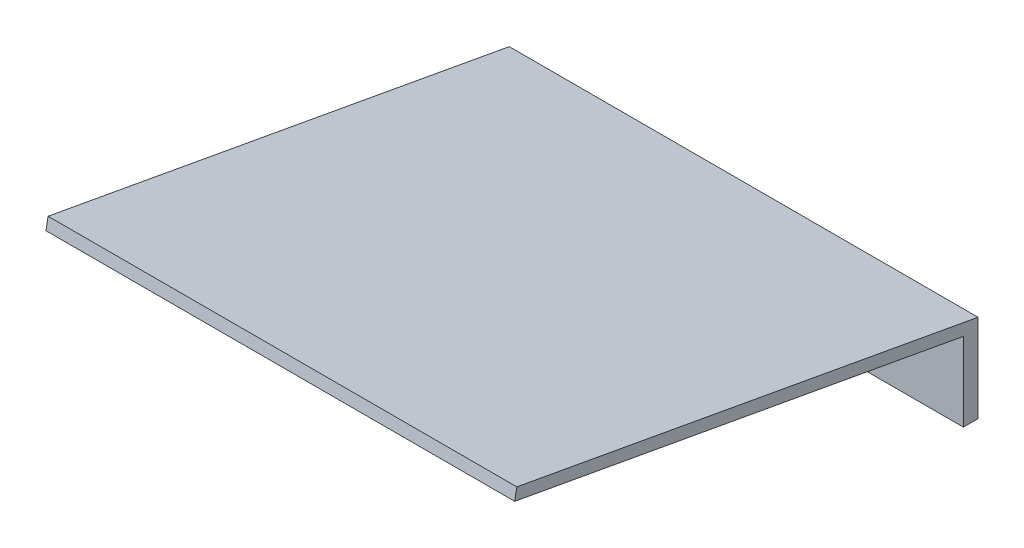
ISO-10303-21;
HEADER;
FILE_DESCRIPTION(('STEP AP214'),'2;1');
FILE_NAME('part.step','',(''),(''),'','','');
FILE_SCHEMA(('AUTOMOTIVE_DESIGN { 1 0 10303 214 1 1 1 1 }'));
ENDSEC;
DATA;
#1=APPLICATION_CONTEXT('core data for automotive mechanical design processes');
#2=APPLICATION_PROTOCOL_DEFINITION('international standard','automotive_design',2000,#1);
#3=PRODUCT_CONTEXT('',#1,'mechanical');
#4=PRODUCT('Part','Part','',(#3));
#5=PRODUCT_RELATED_PRODUCT_CATEGORY('part','',(#4));
#6=PRODUCT_DEFINITION_FORMATION('','',#4);
#7=PRODUCT_DEFINITION_CONTEXT('part definition',#1,'design');
#8=PRODUCT_DEFINITION('design','',#6,#7);
#9=PRODUCT_DEFINITION_SHAPE('','',#8);
#10=(LENGTH_UNIT() NAMED_UNIT(*) SI_UNIT(.MILLI.,.METRE.));
#11=(NAMED_UNIT(*) PLANE_ANGLE_UNIT() SI_UNIT($,.RADIAN.));
#12=(NAMED_UNIT(*) SI_UNIT($,.STERADIAN.) SOLID_ANGLE_UNIT());
#13=UNCERTAINTY_MEASURE_WITH_UNIT(LENGTH_MEASURE(1.E-05),#10,'distance_accuracy_value','');
#14=(GEOMETRIC_REPRESENTATION_CONTEXT(3) GLOBAL_UNCERTAINTY_ASSIGNED_CONTEXT((#13)) GLOBAL_UNIT_ASSIGNED_CONTEXT((#10,
#11,#12)) REPRESENTATION_CONTEXT('',''));
#15=CARTESIAN_POINT('',(0.,0.,0.));
#16=DIRECTION('',(0.,0.,1.));
#17=DIRECTION('',(1.,0.,0.));
#18=AXIS2_PLACEMENT_3D('',#15,#16,#17);
#19=CARTESIAN_POINT('',(40.,13.4210348666984,2.5));
#20=DIRECTION('',(0.,0.,1.));
#21=DIRECTION('',(1.,0.,0.));
#22=AXIS2_PLACEMENT_3D('',#19,#20,#21);
#23=PLANE('',#22);
#24=DIRECTION('',(0.,-1.,0.));
#25=VECTOR('',#24,1.);
#26=CARTESIAN_POINT('',(120.,13.4210348666984,2.5));
#27=LINE('',#26,#25);
#28=CARTESIAN_POINT('',(120.,13.4210348666984,2.5));
#29=VERTEX_POINT('',#28);
#30=CARTESIAN_POINT('',(120.,0.,2.5));
#31=VERTEX_POINT('',#30);
#32=EDGE_CURVE('E118',#29,#31,#27,.T.);
#33=ORIENTED_EDGE('',*,*,#32,.F.);
#34=DIRECTION('',(1.,0.,0.));
#35=VECTOR('',#34,1.);
#36=CARTESIAN_POINT('',(40.,13.4210348666984,2.5));
#37=LINE('',#36,#35);
#38=CARTESIAN_POINT('',(40.,13.4210348666984,2.5));
#39=VERTEX_POINT('',#38);
#40=EDGE_CURVE('E11',#39,#29,#37,.T.);
#41=ORIENTED_EDGE('',*,*,#40,.F.);
#42=DIRECTION('',(0.,-1.,0.));
#43=VECTOR('',#42,1.);
#44=CARTESIAN_POINT('',(40.,13.4210348666984,2.5));
#45=LINE('',#44,#43);
#46=CARTESIAN_POINT('',(40.,0.,2.5));
#47=VERTEX_POINT('',#46);
#48=EDGE_CURVE('E132',#39,#47,#45,.T.);
#49=ORIENTED_EDGE('',*,*,#48,.T.);
#50=DIRECTION('',(1.,0.,0.));
#51=VECTOR('',#50,1.);
#52=CARTESIAN_POINT('',(40.,0.,2.5));
#53=LINE('',#52,#51);
#54=EDGE_CURVE('E36',#47,#31,#53,.T.);
#55=ORIENTED_EDGE('',*,*,#54,.T.);
#56=EDGE_LOOP('',(#33,#41,#49,#55));
#57=FACE_BOUND('',#56,.T.);
#58=ADVANCED_FACE('F33',(#57),#23,.T.);
#59=CARTESIAN_POINT('',(40.,27.3173186584393,79.0713833258687));
#60=DIRECTION('',(0.,-0.983928174383606,0.178564687590081));
#61=DIRECTION('',(0.,-0.178564687590081,-0.983928174383607));
#62=AXIS2_PLACEMENT_3D('',#59,#60,#61);
#63=PLANE('',#62);
#64=DIRECTION('',(0.,-0.178564687590081,-0.983928174383606));
#65=VECTOR('',#64,1.);
#66=CARTESIAN_POINT('',(120.,27.3173186584393,79.0713833258687));
#67=LINE('',#66,#65);
#68=CARTESIAN_POINT('',(120.,27.3173186584393,79.0713833258687));
#69=VERTEX_POINT('',#68);
#70=EDGE_CURVE('E130',#69,#29,#67,.T.);
#71=ORIENTED_EDGE('',*,*,#70,.F.);
#72=DIRECTION('',(1.,0.,0.));
#73=VECTOR('',#72,1.);
#74=CARTESIAN_POINT('',(40.,27.3173186584393,79.0713833258687));
#75=LINE('',#74,#73);
#76=CARTESIAN_POINT('',(40.,27.3173186584393,79.0713833258687));
#77=VERTEX_POINT('',#76);
#78=EDGE_CURVE('E42',#77,#69,#75,.T.);
#79=ORIENTED_EDGE('',*,*,#78,.F.);
#80=DIRECTION('',(0.,-0.178564687590081,-0.983928174383606));
#81=VECTOR('',#80,1.);
#82=CARTESIAN_POINT('',(40.,27.3173186584393,79.0713833258687));
#83=LINE('',#82,#81);
#84=EDGE_CURVE('E108',#77,#39,#83,.T.);
#85=ORIENTED_EDGE('',*,*,#84,.T.);
#86=ORIENTED_EDGE('',*,*,#40,.T.);
#87=EDGE_LOOP('',(#71,#79,#85,#86));
#88=FACE_BOUND('',#87,.T.);
#89=ADVANCED_FACE('F140',(#88),#63,.T.);
#90=CARTESIAN_POINT('',(40.,29.2851750072065,78.7142539506885));
#91=DIRECTION('',(0.,0.178564687590079,0.983928174383607));
#92=DIRECTION('',(0.,-0.983928174383607,0.178564687590079));
#93=AXIS2_PLACEMENT_3D('',#90,#91,#92);
#94=PLANE('',#93);
#95=DIRECTION('',(0.,-0.983928174383607,0.178564687590079));
#96=VECTOR('',#95,1.);
#97=CARTESIAN_POINT('',(120.,29.2851750072065,78.7142539506885));
#98=LINE('',#97,#96);
#99=CARTESIAN_POINT('',(120.,29.2851750072065,78.7142539506885));
#100=VERTEX_POINT('',#99);
#101=EDGE_CURVE('E95',#100,#69,#98,.T.);
#102=ORIENTED_EDGE('',*,*,#101,.F.);
#103=DIRECTION('',(1.,0.,0.));
#104=VECTOR('',#103,1.);
#105=CARTESIAN_POINT('',(40.,29.2851750072065,78.7142539506885));
#106=LINE('',#105,#104);
#107=CARTESIAN_POINT('',(40.,29.2851750072065,78.7142539506885));
#108=VERTEX_POINT('',#107);
#109=EDGE_CURVE('E90',#108,#100,#106,.T.);
#110=ORIENTED_EDGE('',*,*,#109,.F.);
#111=DIRECTION('',(0.,-0.983928174383607,0.178564687590079));
#112=VECTOR('',#111,1.);
#113=CARTESIAN_POINT('',(40.,29.2851750072065,78.7142539506885));
#114=LINE('',#113,#112);
#115=EDGE_CURVE('E93',#108,#77,#114,.T.);
#116=ORIENTED_EDGE('',*,*,#115,.T.);
#117=ORIENTED_EDGE('',*,*,#78,.T.);
#118=EDGE_LOOP('',(#102,#110,#116,#117));
#119=FACE_BOUND('',#118,.T.);
#120=ADVANCED_FACE('F92',(#119),#94,.T.);
#121=CARTESIAN_POINT('',(40.,15.,0.));
#122=DIRECTION('',(0.,0.983928174383606,-0.178564687590082));
#123=DIRECTION('',(0.,0.178564687590082,0.983928174383606));
#124=AXIS2_PLACEMENT_3D('',#121,#122,#123);
#125=PLANE('',#124);
#126=DIRECTION('',(0.,0.178564687590082,0.983928174383606));
#127=VECTOR('',#126,1.);
#128=CARTESIAN_POINT('',(120.,15.,0.));
#129=LINE('',#128,#127);
#130=CARTESIAN_POINT('',(120.,15.,0.));
#131=VERTEX_POINT('',#130);
#132=EDGE_CURVE('E127',#131,#100,#129,.T.);
#133=ORIENTED_EDGE('',*,*,#132,.F.);
#134=DIRECTION('',(1.,0.,0.));
#135=VECTOR('',#134,1.);
#136=CARTESIAN_POINT('',(40.,15.,0.));
#137=LINE('',#136,#135);
#138=CARTESIAN_POINT('',(40.,15.,0.));
#139=VERTEX_POINT('',#138);
#140=EDGE_CURVE('E100',#139,#131,#137,.T.);
#141=ORIENTED_EDGE('',*,*,#140,.F.);
#142=DIRECTION('',(0.,0.178564687590082,0.983928174383606));
#143=VECTOR('',#142,1.);
#144=CARTESIAN_POINT('',(40.,15.,0.));
#145=LINE('',#144,#143);
#146=EDGE_CURVE('E106',#139,#108,#145,.T.);
#147=ORIENTED_EDGE('',*,*,#146,.T.);
#148=ORIENTED_EDGE('',*,*,#109,.T.);
#149=EDGE_LOOP('',(#133,#141,#147,#148));
#150=FACE_BOUND('',#149,.T.);
#151=ADVANCED_FACE('F110',(#150),#125,.T.);
#152=CARTESIAN_POINT('',(40.,0.,0.));
#153=DIRECTION('',(0.,0.,-1.));
#154=DIRECTION('',(-1.,0.,0.));
#155=AXIS2_PLACEMENT_3D('',#152,#153,#154);
#156=PLANE('',#155);
#157=DIRECTION('',(0.,1.,0.));
#158=VECTOR('',#157,1.);
#159=CARTESIAN_POINT('',(120.,0.,0.));
#160=LINE('',#159,#158);
#161=CARTESIAN_POINT('',(120.,0.,0.));
#162=VERTEX_POINT('',#161);
#163=EDGE_CURVE('E124',#162,#131,#160,.T.);
#164=ORIENTED_EDGE('',*,*,#163,.F.);
#165=DIRECTION('',(1.,0.,0.));
#166=VECTOR('',#165,1.);
#167=CARTESIAN_POINT('',(40.,0.,0.));
#168=LINE('',#167,#166);
#169=CARTESIAN_POINT('',(40.,0.,0.));
#170=VERTEX_POINT('',#169);
#171=EDGE_CURVE('E135',#170,#162,#168,.T.);
#172=ORIENTED_EDGE('',*,*,#171,.F.);
#173=DIRECTION('',(0.,1.,0.));
#174=VECTOR('',#173,1.);
#175=CARTESIAN_POINT('',(40.,0.,0.));
#176=LINE('',#175,#174);
#177=EDGE_CURVE('E111',#170,#139,#176,.T.);
#178=ORIENTED_EDGE('',*,*,#177,.T.);
#179=ORIENTED_EDGE('',*,*,#140,.T.);
#180=EDGE_LOOP('',(#164,#172,#178,#179));
#181=FACE_BOUND('',#180,.T.);
#182=ADVANCED_FACE('F153',(#181),#156,.T.);
#183=CARTESIAN_POINT('',(40.,0.,2.5));
#184=DIRECTION('',(0.,-1.,0.));
#185=DIRECTION('',(0.,0.,-1.));
#186=AXIS2_PLACEMENT_3D('',#183,#184,#185);
#187=PLANE('',#186);
#188=DIRECTION('',(0.,0.,-1.));
#189=VECTOR('',#188,1.);
#190=CARTESIAN_POINT('',(120.,0.,2.5));
#191=LINE('',#190,#189);
#192=EDGE_CURVE('E121',#31,#162,#191,.T.);
#193=ORIENTED_EDGE('',*,*,#192,.F.);
#194=ORIENTED_EDGE('',*,*,#54,.F.);
#195=DIRECTION('',(0.,0.,-1.));
#196=VECTOR('',#195,1.);
#197=CARTESIAN_POINT('',(40.,0.,2.5));
#198=LINE('',#197,#196);
#199=EDGE_CURVE('E113',#47,#170,#198,.T.);
#200=ORIENTED_EDGE('',*,*,#199,.T.);
#201=ORIENTED_EDGE('',*,*,#171,.T.);
#202=EDGE_LOOP('',(#193,#194,#200,#201));
#203=FACE_BOUND('',#202,.T.);
#204=ADVANCED_FACE('F137',(#203),#187,.T.);
#205=CARTESIAN_POINT('',(40.,0.,0.));
#206=DIRECTION('',(1.,0.,0.));
#207=DIRECTION('',(0.,0.,-1.));
#208=AXIS2_PLACEMENT_3D('',#205,#206,#207);
#209=PLANE('',#208);
#210=ORIENTED_EDGE('',*,*,#48,.F.);
#211=ORIENTED_EDGE('',*,*,#84,.F.);
#212=ORIENTED_EDGE('',*,*,#115,.F.);
#213=ORIENTED_EDGE('',*,*,#146,.F.);
#214=ORIENTED_EDGE('',*,*,#177,.F.);
#215=ORIENTED_EDGE('',*,*,#199,.F.);
#216=EDGE_LOOP('',(#210,#211,#212,#213,#214,#215));
#217=FACE_BOUND('',#216,.T.);
#218=ADVANCED_FACE('F104',(#217),#209,.F.);
#219=CARTESIAN_POINT('',(120.,0.,0.));
#220=DIRECTION('',(1.,0.,0.));
#221=DIRECTION('',(0.,0.,-1.));
#222=AXIS2_PLACEMENT_3D('',#219,#220,#221);
#223=PLANE('',#222);
#224=ORIENTED_EDGE('',*,*,#32,.T.);
#225=ORIENTED_EDGE('',*,*,#192,.T.);
#226=ORIENTED_EDGE('',*,*,#163,.T.);
#227=ORIENTED_EDGE('',*,*,#132,.T.);
#228=ORIENTED_EDGE('',*,*,#101,.T.);
#229=ORIENTED_EDGE('',*,*,#70,.T.);
#230=EDGE_LOOP('',(#224,#225,#226,#227,#228,#229));
#231=FACE_BOUND('',#230,.T.);
#232=ADVANCED_FACE('F139',(#231),#223,.T.);
#233=CLOSED_SHELL('',(#58,#89,#120,#151,#182,#204,#218,#232));
#234=MANIFOLD_SOLID_BREP('B2',#233);
#235=ADVANCED_BREP_SHAPE_REPRESENTATION('',(#18,#234),#14);
#236=SHAPE_DEFINITION_REPRESENTATION(#9,#235);
ENDSEC;
END-ISO-10303-21;
